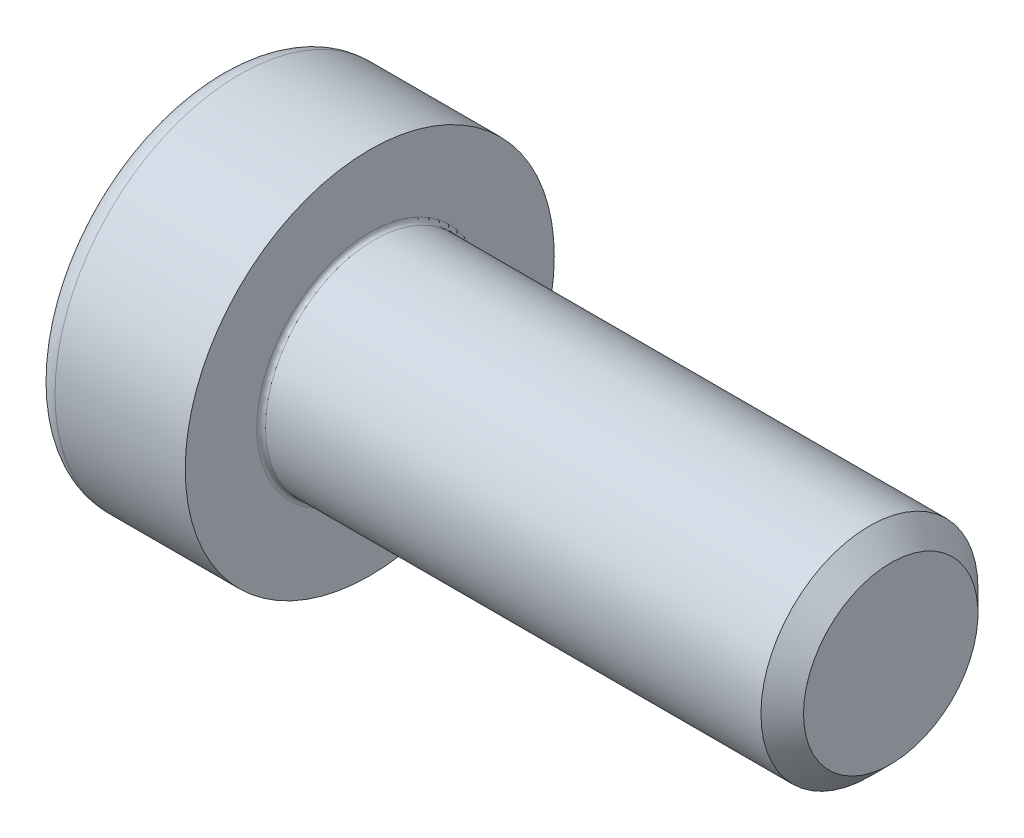
ISO-10303-21;
HEADER;
FILE_DESCRIPTION(('STEP AP214'),'2;1');
FILE_NAME('part.step','',(''),(''),'','','');
FILE_SCHEMA(('AUTOMOTIVE_DESIGN { 1 0 10303 214 1 1 1 1 }'));
ENDSEC;
DATA;
#1=APPLICATION_CONTEXT('core data for automotive mechanical design processes');
#2=APPLICATION_PROTOCOL_DEFINITION('international standard','automotive_design',2000,#1);
#3=PRODUCT_CONTEXT('',#1,'mechanical');
#4=PRODUCT('Part','Part','',(#3));
#5=PRODUCT_RELATED_PRODUCT_CATEGORY('part','',(#4));
#6=PRODUCT_DEFINITION_FORMATION('','',#4);
#7=PRODUCT_DEFINITION_CONTEXT('part definition',#1,'design');
#8=PRODUCT_DEFINITION('design','',#6,#7);
#9=PRODUCT_DEFINITION_SHAPE('','',#8);
#10=(LENGTH_UNIT() NAMED_UNIT(*) SI_UNIT(.MILLI.,.METRE.));
#11=(NAMED_UNIT(*) PLANE_ANGLE_UNIT() SI_UNIT($,.RADIAN.));
#12=(NAMED_UNIT(*) SI_UNIT($,.STERADIAN.) SOLID_ANGLE_UNIT());
#13=UNCERTAINTY_MEASURE_WITH_UNIT(LENGTH_MEASURE(1.E-05),#10,'distance_accuracy_value','');
#14=(GEOMETRIC_REPRESENTATION_CONTEXT(3) GLOBAL_UNCERTAINTY_ASSIGNED_CONTEXT((#13)) GLOBAL_UNIT_ASSIGNED_CONTEXT((#10,
#11,#12)) REPRESENTATION_CONTEXT('',''));
#15=CARTESIAN_POINT('',(0.,0.,0.));
#16=DIRECTION('',(0.,0.,1.));
#17=DIRECTION('',(1.,0.,0.));
#18=AXIS2_PLACEMENT_3D('',#15,#16,#17);
#19=CARTESIAN_POINT('',(-3.5,1.5,0.866025403784437));
#20=DIRECTION('',(0.,1.,0.));
#21=DIRECTION('',(0.,0.,1.));
#22=AXIS2_PLACEMENT_3D('',#19,#20,#21);
#23=PLANE('',#22);
#24=DIRECTION('',(0.,0.,1.));
#25=VECTOR('',#24,1.);
#26=CARTESIAN_POINT('',(-3.5,1.5,0.866025403784437));
#27=LINE('',#26,#25);
#28=CARTESIAN_POINT('',(-3.5,1.5,-0.86602540378444));
#29=VERTEX_POINT('',#28);
#30=CARTESIAN_POINT('',(-3.5,1.50000001434956,0.866025395499716));
#31=VERTEX_POINT('',#30);
#32=EDGE_CURVE('E81',#29,#31,#27,.T.);
#33=ORIENTED_EDGE('',*,*,#32,.F.);
#34=DIRECTION('',(1.,0.,0.));
#35=VECTOR('',#34,1.);
#36=CARTESIAN_POINT('',(-3.5,1.5,-0.86602540378444));
#37=LINE('',#36,#35);
#38=CARTESIAN_POINT('',(-0.800000006220233,1.5,-0.866025425304596));
#39=VERTEX_POINT('',#38);
#40=EDGE_CURVE('E84',#29,#39,#37,.T.);
#41=ORIENTED_EDGE('',*,*,#40,.T.);
#42=CARTESIAN_POINT('',(-0.800000012432567,1.5,-0.866025446824751));
#43=CARTESIAN_POINT('',(-0.778021670271403,1.5,-0.789912302835366));
#44=CARTESIAN_POINT('',(-0.758033518179528,1.5,-0.713142151271645));
#45=CARTESIAN_POINT('',(-0.72314479867253,1.5,-0.558272624270886));
#46=CARTESIAN_POINT('',(-0.708256572216875,1.5,-0.480170497997477));
#47=CARTESIAN_POINT('',(-0.685081973853415,1.5,-0.324934125860524));
#48=CARTESIAN_POINT('',(-0.676641344183139,1.5,-0.247823758413355));
#49=CARTESIAN_POINT('',(-0.666566877354559,1.5,-0.0932403829638634));
#50=CARTESIAN_POINT('',(-0.664924695666526,1.5,-0.0157679364446982));
#51=CARTESIAN_POINT('',(-0.668349715793717,1.5,0.128981011040013));
#52=CARTESIAN_POINT('',(-0.672575960514088,1.5,0.196279232771601));
#53=CARTESIAN_POINT('',(-0.685967968078844,1.5,0.330437250397973));
#54=CARTESIAN_POINT('',(-0.695138301128548,1.5,0.397296582622611));
#55=CARTESIAN_POINT('',(-0.718062359334658,1.5,0.531730978494216));
#56=CARTESIAN_POINT('',(-0.731913212733723,1.5,0.599289036243065));
#57=CARTESIAN_POINT('',(-0.7633487947386,1.5,0.733397814904674));
#58=CARTESIAN_POINT('',(-0.780926141976628,1.5,0.79995025257974));
#59=CARTESIAN_POINT('',(-0.799999966613416,1.5,0.866025288102551));
#60=B_SPLINE_CURVE_WITH_KNOTS('',3,(#42,#43,#44,#45,#46,#47,#48,#49,#50,#51,#52,#53,#54,#55,#56,
#57,#58,#59),.UNSPECIFIED.,.F.,.F.,(4,2,2,2,2,2,2,2,4),(0.,0.237762011454513,0.476095368404175,
0.708530713077614,0.940680677948168,1.14278082709105,1.3450681142283,1.55184116343041,
1.75820840456203),.UNSPECIFIED.);
#61=CARTESIAN_POINT('',(-0.799999990873968,1.50000002268993,0.866025332843458));
#62=VERTEX_POINT('',#61);
#63=EDGE_CURVE('E70',#39,#62,#60,.T.);
#64=ORIENTED_EDGE('',*,*,#63,.T.);
#65=DIRECTION('',(1.,0.,0.));
#66=VECTOR('',#65,1.);
#67=CARTESIAN_POINT('',(-3.5,1.50000002152434,0.866025391357355));
#68=LINE('',#67,#66);
#69=EDGE_CURVE('E97',#62,#31,#68,.F.);
#70=ORIENTED_EDGE('',*,*,#69,.T.);
#71=EDGE_LOOP('',(#33,#41,#64,#70));
#72=FACE_BOUND('',#71,.T.);
#73=ADVANCED_FACE('F17',(#72),#23,.F.);
#74=CARTESIAN_POINT('',(-3.5,0.,1.73205080756888));
#75=DIRECTION('',(0.,0.500000000000001,0.866025403784438));
#76=DIRECTION('',(0.,-0.866025403784438,0.500000000000001));
#77=AXIS2_PLACEMENT_3D('',#74,#75,#76);
#78=PLANE('',#77);
#79=DIRECTION('',(0.,-0.866025403784438,0.500000000000001));
#80=VECTOR('',#79,1.);
#81=CARTESIAN_POINT('',(-3.5,0.,1.73205080756888));
#82=LINE('',#81,#80);
#83=CARTESIAN_POINT('',(-3.5,2.36670641556077E-09,1.7320508089353));
#84=VERTEX_POINT('',#83);
#85=EDGE_CURVE('E94',#31,#84,#82,.T.);
#86=ORIENTED_EDGE('',*,*,#85,.F.);
#87=ORIENTED_EDGE('',*,*,#69,.F.);
#88=CARTESIAN_POINT('',(-0.799999999140521,2.60213949590292E-09,1.73205080606653));
#89=CARTESIAN_POINT('',(-0.778021658051909,0.0659159182442528,1.69399423442668));
#90=CARTESIAN_POINT('',(-0.758033507103695,0.132400819132616,1.65560915900174));
#91=CARTESIAN_POINT('',(-0.723144789979647,0.266521762493608,1.5781743962483));
#92=CARTESIAN_POINT('',(-0.708256564762364,0.334160187260099,1.53912333350181));
#93=CARTESIAN_POINT('',(-0.685081968883998,0.468598827673235,1.46150514826979));
#94=CARTESIAN_POINT('',(-0.676641340456116,0.535378364006075,1.42294996499167));
#95=CARTESIAN_POINT('',(-0.666566876015663,0.669251492511701,1.34565827821169));
#96=CARTESIAN_POINT('',(-0.664924695473804,0.736344598425948,1.30692205545133));
#97=CARTESIAN_POINT('',(-0.668349717825078,0.861700872474557,1.23454757688476));
#98=CARTESIAN_POINT('',(-0.672575964554391,0.919982851332367,1.2008984607023));
#99=CARTESIAN_POINT('',(-0.68596797755536,1.03616712093172,1.13381944137351));
#100=CARTESIAN_POINT('',(-0.695138314035785,1.09406901012273,1.10038977006249));
#101=CARTESIAN_POINT('',(-0.718062380279471,1.21049263027525,1.0331725616274));
#102=CARTESIAN_POINT('',(-0.731913238329181,1.26899963368743,0.999393527457905));
#103=CARTESIAN_POINT('',(-0.763348830357798,1.38514126087301,0.932339127738187));
#104=CARTESIAN_POINT('',(-0.780926182963769,1.44277737140747,0.899062903806075));
#105=CARTESIAN_POINT('',(-0.800000013151562,1.50000003943099,0.866025381018948));
#106=B_SPLINE_CURVE_WITH_KNOTS('',3,(#88,#89,#90,#91,#92,#93,#94,#95,#96,#97,#98,#99,#100,#101,
#102,#103,#104,#105),.UNSPECIFIED.,.F.,.F.,(4,2,2,2,2,2,2,2,4),(0.,0.237762008511598,
0.47609536245894,0.708530704067682,0.940680665888395,1.14278084715299,1.3450681665294,
1.5518412496249,1.75820852438055),.UNSPECIFIED.);
#107=CARTESIAN_POINT('',(-0.800000000237238,2.18858450204986E-09,1.73205080791087));
#108=VERTEX_POINT('',#107);
#109=EDGE_CURVE('E77',#108,#62,#106,.T.);
#110=ORIENTED_EDGE('',*,*,#109,.F.);
#111=DIRECTION('',(1.,0.,0.));
#112=VECTOR('',#111,1.);
#113=CARTESIAN_POINT('',(-3.5,3.55005911820139E-09,1.7320508096185));
#114=LINE('',#113,#112);
#115=EDGE_CURVE('E206',#108,#84,#114,.F.);
#116=ORIENTED_EDGE('',*,*,#115,.T.);
#117=EDGE_LOOP('',(#86,#87,#110,#116));
#118=FACE_BOUND('',#117,.T.);
#119=ADVANCED_FACE('F122',(#118),#78,.F.);
#120=CARTESIAN_POINT('',(-3.5,1.5,-0.86602540378444));
#121=DIRECTION('',(0.,0.5,-0.866025403784439));
#122=DIRECTION('',(0.,0.866025403784439,0.5));
#123=AXIS2_PLACEMENT_3D('',#120,#121,#122);
#124=PLANE('',#123);
#125=DIRECTION('',(0.,0.866025403784439,0.5));
#126=VECTOR('',#125,1.);
#127=CARTESIAN_POINT('',(-3.5,1.5,-0.86602540378444));
#128=LINE('',#127,#126);
#129=CARTESIAN_POINT('',(-3.5,0.,-1.73205080756888));
#130=VERTEX_POINT('',#129);
#131=EDGE_CURVE('E88',#130,#29,#128,.T.);
#132=ORIENTED_EDGE('',*,*,#131,.F.);
#133=DIRECTION('',(1.,0.,0.));
#134=VECTOR('',#133,1.);
#135=CARTESIAN_POINT('',(-3.5,0.,-1.73205080756888));
#136=LINE('',#135,#134);
#137=CARTESIAN_POINT('',(-0.799999996147988,-2.59692836892128E-08,-1.73205080088601));
#138=VERTEX_POINT('',#137);
#139=EDGE_CURVE('E92',#130,#138,#136,.T.);
#140=ORIENTED_EDGE('',*,*,#139,.T.);
#141=CARTESIAN_POINT('',(-0.799999984583663,1.49999999398993,-0.866025426121797));
#142=CARTESIAN_POINT('',(-0.778021650520149,1.43408407271741,-0.904081988921267));
#143=CARTESIAN_POINT('',(-0.758033502808757,1.36759917014434,-0.942467060358707));
#144=CARTESIAN_POINT('',(-0.723144788711201,1.23347822683197,-1.01990181944736));
#145=CARTESIAN_POINT('',(-0.708256563281757,1.165839803806,-1.05895288252755));
#146=CARTESIAN_POINT('',(-0.68508196769442,1.03140116576452,-1.13657106734227));
#147=CARTESIAN_POINT('',(-0.676641339767,0.964621630082855,-1.1751262498997));
#148=CARTESIAN_POINT('',(-0.666566875935023,0.830748503178975,-1.25241793550448));
#149=CARTESIAN_POINT('',(-0.664924695498078,0.763655398215178,-1.29115415780985));
#150=CARTESIAN_POINT('',(-0.668349717905383,0.638299126743436,-1.36352863494737));
#151=CARTESIAN_POINT('',(-0.672575964523277,0.580017149518255,-1.39717775016728));
#152=CARTESIAN_POINT('',(-0.685967977017522,0.463832883152867,-1.4642567676142));
#153=CARTESIAN_POINT('',(-0.69513831310386,0.405930995563309,-1.49768643800586));
#154=CARTESIAN_POINT('',(-0.718062378311161,0.28950737874517,-1.56490364452014));
#155=CARTESIAN_POINT('',(-0.731913235702844,0.231000377063204,-1.59868267768962));
#156=CARTESIAN_POINT('',(-0.763348826236472,0.114858753307733,-1.66573707542679));
#157=CARTESIAN_POINT('',(-0.780926178004428,0.0572226444729956,-1.69901329837649));
#158=CARTESIAN_POINT('',(-0.800000007299001,-2.18733048714975E-08,-1.73205082019744));
#159=B_SPLINE_CURVE_WITH_KNOTS('',3,(#141,#142,#143,#144,#145,#146,#147,#148,#149,#150,#151,
#152,#153,#154,#155,#156,#157,#158),.UNSPECIFIED.,.F.,.F.,(4,2,2,2,2,2,2,2,4),(0.,
0.23776200453855,0.476095354800071,0.708530693417361,0.940680652127613,1.14278082770383,
1.34506814144736,1.55184121828047,1.75820848670916),.UNSPECIFIED.);
#160=EDGE_CURVE('E74',#39,#138,#159,.T.);
#161=ORIENTED_EDGE('',*,*,#160,.F.);
#162=ORIENTED_EDGE('',*,*,#40,.F.);
#163=EDGE_LOOP('',(#132,#140,#161,#162));
#164=FACE_BOUND('',#163,.T.);
#165=ADVANCED_FACE('F90',(#164),#124,.F.);
#166=CARTESIAN_POINT('',(-0.805999997623985,0.,0.));
#167=DIRECTION('',(-1.,0.,0.));
#168=DIRECTION('',(0.,0.,1.));
#169=AXIS2_PLACEMENT_3D('',#166,#167,#168);
#170=CONICAL_SURFACE('',#169,1.74244310829863,1.04719755119367);
#171=CARTESIAN_POINT('',(0.200000000006639,0.,0.));
#172=VERTEX_POINT('',#171);
#173=VERTEX_LOOP('',#172);
#174=FACE_BOUND('',#173,.T.);
#175=ORIENTED_EDGE('',*,*,#160,.T.);
#176=CARTESIAN_POINT('',(-0.799999988529364,-3.44122793442723E-08,-1.73205078770094));
#177=CARTESIAN_POINT('',(-0.778021648311073,-0.0659159495199128,-1.69399421636967));
#178=CARTESIAN_POINT('',(-0.758033498287448,-0.132400849870365,-1.65560914125529));
#179=CARTESIAN_POINT('',(-0.723144783082687,-0.266521792102774,-1.57817437915344));
#180=CARTESIAN_POINT('',(-0.70825655885892,-0.334160216278253,-1.53912331674817));
#181=CARTESIAN_POINT('',(-0.685081964946078,-0.468598855527711,-1.46150513218801));
#182=CARTESIAN_POINT('',(-0.676641337495724,-0.535378391290187,-1.42294994923918));
#183=CARTESIAN_POINT('',(-0.666566874944027,-0.669251518588872,-1.34565826315603));
#184=CARTESIAN_POINT('',(-0.664924695314174,-0.736344623866673,-1.30692204076312));
#185=CARTESIAN_POINT('',(-0.668349719123336,-0.861700893152402,-1.2345475649464));
#186=CARTESIAN_POINT('',(-0.672575966101573,-0.91998286789904,-1.20089845113753));
#187=CARTESIAN_POINT('',(-0.685967978869557,-1.03616712930376,-1.13381943653991));
#188=CARTESIAN_POINT('',(-0.695138314866413,-1.09406901441143,-1.10038976758641));
#189=CARTESIAN_POINT('',(-0.718062379492155,-1.21049262627729,-1.03317256393563));
#190=CARTESIAN_POINT('',(-0.731913236384259,-1.26899962548969,-0.999393532190876));
#191=CARTESIAN_POINT('',(-0.763348825615376,-1.38514124441669,-0.932339137239251));
#192=CARTESIAN_POINT('',(-0.780926176583787,-1.44277735089185,-0.899062915650775));
#193=CARTESIAN_POINT('',(-0.800000004972312,-1.50000001491657,-0.866025395172358));
#194=B_SPLINE_CURVE_WITH_KNOTS('',3,(#176,#177,#178,#179,#180,#181,#182,#183,#184,#185,#186,
#187,#188,#189,#190,#191,#192,#193),.UNSPECIFIED.,.F.,.F.,(4,2,2,2,2,2,2,2,4),(0.,
0.2377620060049,0.476095357377757,0.708530696703011,0.940680656266892,1.14278082341054,
1.34506812861263,1.55184119678181,1.75820845671576),.UNSPECIFIED.);
#195=CARTESIAN_POINT('',(-0.800000002758283,-1.50000000827448,-0.866025399007168));
#196=VERTEX_POINT('',#195);
#197=EDGE_CURVE('E185',#138,#196,#194,.T.);
#198=ORIENTED_EDGE('',*,*,#197,.T.);
#199=CARTESIAN_POINT('',(-0.799999989622273,-1.5,-0.866025367834514));
#200=CARTESIAN_POINT('',(-0.778021649314475,-1.5,-0.789912225108993));
#201=CARTESIAN_POINT('',(-0.758033499195718,-1.5,-0.71314207481686));
#202=CARTESIAN_POINT('',(-0.723144783793387,-1.5,-0.558272550480237));
#203=CARTESIAN_POINT('',(-0.708256559467297,-1.5,-0.480170425600095));
#204=CARTESIAN_POINT('',(-0.685081965351673,-1.5,-0.324934056341402));
#205=CARTESIAN_POINT('',(-0.676641337800399,-1.5,-0.247823690375233));
#206=CARTESIAN_POINT('',(-0.666566875053828,-1.5,-0.0932403180638876));
#207=CARTESIAN_POINT('',(-0.664924695329943,-1.5,-0.0157678732015718));
#208=CARTESIAN_POINT('',(-0.668349718984917,-1.5,0.12898107883546));
#209=CARTESIAN_POINT('',(-0.672575965920744,-1.5,0.196279306778827));
#210=CARTESIAN_POINT('',(-0.685967978656193,-1.5,0.330437336624712));
#211=CARTESIAN_POINT('',(-0.69513831466304,-1.5,0.39729667485675));
#212=CARTESIAN_POINT('',(-0.71806237935618,-1.5,0.53173108281893));
#213=CARTESIAN_POINT('',(-0.731913236307367,-1.5,0.599289146643764));
#214=CARTESIAN_POINT('',(-0.76334882569326,-1.5,0.733397937206872));
#215=CARTESIAN_POINT('',(-0.780926176757203,-1.5,0.799950380708394));
#216=CARTESIAN_POINT('',(-0.80000000525412,-1.5,0.866025421984823));
#217=B_SPLINE_CURVE_WITH_KNOTS('',3,(#199,#200,#201,#202,#203,#204,#205,#206,#207,#208,#209,
#210,#211,#212,#213,#214,#215,#216),.UNSPECIFIED.,.F.,.F.,(4,2,2,2,2,2,2,2,4),(0.,
0.237762006261274,0.476095357897238,0.708530697459831,0.940680657258487,1.14278082536587,
1.34506813153537,1.55184120072383,1.75820846167024),.UNSPECIFIED.);
#218=CARTESIAN_POINT('',(-0.799999998563129,-1.49999998741677,0.866025420601342));
#219=VERTEX_POINT('',#218);
#220=EDGE_CURVE('E176',#196,#219,#217,.T.);
#221=ORIENTED_EDGE('',*,*,#220,.T.);
#222=CARTESIAN_POINT('',(-0.799999991611302,-1.49999997483354,0.866025418314301));
#223=CARTESIAN_POINT('',(-0.778021651142396,-1.43408405957754,0.904081989731233));
#224=CARTESIAN_POINT('',(-0.758033500851991,-1.36759915907781,0.942467064931796));
#225=CARTESIAN_POINT('',(-0.723144785092314,-1.23347821653263,1.01990182721422));
#226=CARTESIAN_POINT('',(-0.708256560580681,-1.16583979219357,1.05895288971394));
#227=CARTESIAN_POINT('',(-0.685081966093905,-1.03140115260715,1.13657107446865));
#228=CARTESIAN_POINT('',(-0.676641338357293,-0.964621616671779,1.17512625751729));
#229=CARTESIAN_POINT('',(-0.666566875254049,-0.830748489006765,1.25241794381195));
#230=CARTESIAN_POINT('',(-0.664924695358747,-0.763655383535567,1.29115416631651));
#231=CARTESIAN_POINT('',(-0.66834971869422,-0.638299114669639,1.36352864189086));
#232=CARTESIAN_POINT('',(-0.672575965386404,-0.580017140536749,1.39717775534539));
#233=CARTESIAN_POINT('',(-0.685967977500712,-0.463832880337524,1.46425676924701));
#234=CARTESIAN_POINT('',(-0.695138313129732,-0.405930995821562,1.49768643785889));
#235=CARTESIAN_POINT('',(-0.718062376958103,-0.289507385145422,1.56490364082278));
#236=CARTESIAN_POINT('',(-0.731913233418245,-0.231000386530297,1.5986826722227));
#237=CARTESIAN_POINT('',(-0.763348821758497,-0.114858768772663,1.66573706649919));
#238=CARTESIAN_POINT('',(-0.780926172268345,-0.0572226628696956,1.69901328775731));
#239=CARTESIAN_POINT('',(-0.800000000196727,5.89813991647596E-10,1.73205080790941));
#240=B_SPLINE_CURVE_WITH_KNOTS('',3,(#222,#223,#224,#225,#226,#227,#228,#229,#230,#231,#232,
#233,#234,#235,#236,#237,#238,#239),.UNSPECIFIED.,.F.,.F.,(4,2,2,2,2,2,2,2,4),(0.,
0.237762006708336,0.476095358801109,0.708530698815507,0.940680659063121,1.14278082403675,
1.34506812706112,1.5518411929441,1.75820845061189),.UNSPECIFIED.);
#241=EDGE_CURVE('E87',#219,#108,#240,.T.);
#242=ORIENTED_EDGE('',*,*,#241,.T.);
#243=ORIENTED_EDGE('',*,*,#109,.T.);
#244=ORIENTED_EDGE('',*,*,#63,.F.);
#245=EDGE_LOOP('',(#175,#198,#221,#242,#243,#244));
#246=FACE_BOUND('',#245,.T.);
#247=ADVANCED_FACE('F72',(#174,#246),#170,.F.);
#248=CARTESIAN_POINT('',(-3.5,-1.5,0.866025403784439));
#249=DIRECTION('',(0.,-0.5,0.866025403784439));
#250=DIRECTION('',(0.,-0.866025403784439,-0.5));
#251=AXIS2_PLACEMENT_3D('',#248,#249,#250);
#252=PLANE('',#251);
#253=DIRECTION('',(0.,-0.866025403784439,-0.5));
#254=VECTOR('',#253,1.);
#255=CARTESIAN_POINT('',(-3.5,-1.5,0.866025403784439));
#256=LINE('',#255,#254);
#257=CARTESIAN_POINT('',(-3.5,-1.4999999973103,0.866025417760504));
#258=VERTEX_POINT('',#257);
#259=EDGE_CURVE('E35',#84,#258,#256,.T.);
#260=ORIENTED_EDGE('',*,*,#259,.F.);
#261=ORIENTED_EDGE('',*,*,#115,.F.);
#262=ORIENTED_EDGE('',*,*,#241,.F.);
#263=DIRECTION('',(1.,0.,0.));
#264=VECTOR('',#263,1.);
#265=CARTESIAN_POINT('',(-3.5,-1.5,0.866025428630777));
#266=LINE('',#265,#264);
#267=EDGE_CURVE('E182',#219,#258,#266,.F.);
#268=ORIENTED_EDGE('',*,*,#267,.T.);
#269=EDGE_LOOP('',(#260,#261,#262,#268));
#270=FACE_BOUND('',#269,.T.);
#271=ADVANCED_FACE('F192',(#270),#252,.F.);
#272=CARTESIAN_POINT('',(-3.5,0.,-1.73205080756888));
#273=DIRECTION('',(0.,-0.5,-0.866025403784439));
#274=DIRECTION('',(0.,0.866025403784439,-0.5));
#275=AXIS2_PLACEMENT_3D('',#272,#273,#274);
#276=PLANE('',#275);
#277=DIRECTION('',(0.,0.866025403784439,-0.5));
#278=VECTOR('',#277,1.);
#279=CARTESIAN_POINT('',(-3.5,0.,-1.73205080756888));
#280=LINE('',#279,#278);
#281=CARTESIAN_POINT('',(-3.5,-1.5,-0.86602540378444));
#282=VERTEX_POINT('',#281);
#283=EDGE_CURVE('E210',#282,#130,#280,.T.);
#284=ORIENTED_EDGE('',*,*,#283,.F.);
#285=DIRECTION('',(1.,0.,0.));
#286=VECTOR('',#285,1.);
#287=CARTESIAN_POINT('',(-3.5,-1.5,-0.86602540378444));
#288=LINE('',#287,#286);
#289=EDGE_CURVE('E245',#282,#196,#288,.T.);
#290=ORIENTED_EDGE('',*,*,#289,.T.);
#291=ORIENTED_EDGE('',*,*,#197,.F.);
#292=ORIENTED_EDGE('',*,*,#139,.F.);
#293=EDGE_LOOP('',(#284,#290,#291,#292));
#294=FACE_BOUND('',#293,.T.);
#295=ADVANCED_FACE('F172',(#294),#276,.F.);
#296=CARTESIAN_POINT('',(-3.5,-1.5,-0.866025403784438));
#297=DIRECTION('',(0.,-1.,0.));
#298=DIRECTION('',(0.,0.,-1.));
#299=AXIS2_PLACEMENT_3D('',#296,#297,#298);
#300=PLANE('',#299);
#301=DIRECTION('',(0.,0.,1.));
#302=VECTOR('',#301,1.);
#303=CARTESIAN_POINT('',(-3.5,-1.5,0.));
#304=LINE('',#303,#302);
#305=EDGE_CURVE('E233',#258,#282,#304,.F.);
#306=ORIENTED_EDGE('',*,*,#305,.F.);
#307=ORIENTED_EDGE('',*,*,#267,.F.);
#308=ORIENTED_EDGE('',*,*,#220,.F.);
#309=ORIENTED_EDGE('',*,*,#289,.F.);
#310=EDGE_LOOP('',(#306,#307,#308,#309));
#311=FACE_BOUND('',#310,.T.);
#312=ADVANCED_FACE('F145',(#311),#300,.F.);
#313=CARTESIAN_POINT('',(-3.5,2.99102540378444,0.));
#314=DIRECTION('',(-1.,0.,0.));
#315=DIRECTION('',(0.,-1.,0.));
#316=AXIS2_PLACEMENT_3D('',#313,#314,#315);
#317=PLANE('',#316);
#318=CARTESIAN_POINT('',(-3.5,0.,0.));
#319=DIRECTION('',(1.,0.,0.));
#320=DIRECTION('',(0.,1.,0.));
#321=AXIS2_PLACEMENT_3D('',#318,#319,#320);
#322=CIRCLE('',#321,3.75);
#323=CARTESIAN_POINT('',(-3.5,3.75,0.));
#324=VERTEX_POINT('',#323);
#325=EDGE_CURVE('E229',#324,#324,#322,.T.);
#326=ORIENTED_EDGE('',*,*,#325,.F.);
#327=EDGE_LOOP('',(#326));
#328=FACE_BOUND('',#327,.T.);
#329=ORIENTED_EDGE('',*,*,#259,.T.);
#330=ORIENTED_EDGE('',*,*,#305,.T.);
#331=ORIENTED_EDGE('',*,*,#283,.T.);
#332=ORIENTED_EDGE('',*,*,#131,.T.);
#333=ORIENTED_EDGE('',*,*,#32,.T.);
#334=ORIENTED_EDGE('',*,*,#85,.T.);
#335=EDGE_LOOP('',(#329,#330,#331,#332,#333,#334));
#336=FACE_BOUND('',#335,.T.);
#337=ADVANCED_FACE('F135',(#328,#336),#317,.T.);
#338=CARTESIAN_POINT('',(-3.,0.,0.));
#339=DIRECTION('',(1.,0.,0.));
#340=DIRECTION('',(0.,1.,0.));
#341=AXIS2_PLACEMENT_3D('',#338,#339,#340);
#342=TOROIDAL_SURFACE('',#341,3.75,0.500000000000001);
#343=CARTESIAN_POINT('',(-3.,0.,0.));
#344=DIRECTION('',(1.,0.,0.));
#345=DIRECTION('',(0.,1.,0.));
#346=AXIS2_PLACEMENT_3D('',#343,#344,#345);
#347=CIRCLE('',#346,4.25);
#348=CARTESIAN_POINT('',(-3.,4.25,0.));
#349=VERTEX_POINT('',#348);
#350=EDGE_CURVE('E232',#349,#349,#347,.T.);
#351=ORIENTED_EDGE('',*,*,#350,.F.);
#352=EDGE_LOOP('',(#351));
#353=FACE_BOUND('',#352,.T.);
#354=ORIENTED_EDGE('',*,*,#325,.T.);
#355=EDGE_LOOP('',(#354));
#356=FACE_BOUND('',#355,.T.);
#357=ADVANCED_FACE('F132',(#353,#356),#342,.T.);
#358=CARTESIAN_POINT('',(-1.75,0.,0.));
#359=DIRECTION('',(1.,0.,0.));
#360=DIRECTION('',(0.,1.,0.));
#361=AXIS2_PLACEMENT_3D('',#358,#359,#360);
#362=CYLINDRICAL_SURFACE('',#361,4.25);
#363=ORIENTED_EDGE('',*,*,#350,.T.);
#364=EDGE_LOOP('',(#363));
#365=FACE_BOUND('',#364,.T.);
#366=CARTESIAN_POINT('',(0.,0.,0.));
#367=DIRECTION('',(1.,0.,0.));
#368=DIRECTION('',(0.,1.,0.));
#369=AXIS2_PLACEMENT_3D('',#366,#367,#368);
#370=CIRCLE('',#369,4.25);
#371=CARTESIAN_POINT('',(0.,4.25,0.));
#372=VERTEX_POINT('',#371);
#373=EDGE_CURVE('E183',#372,#372,#370,.T.);
#374=ORIENTED_EDGE('',*,*,#373,.F.);
#375=EDGE_LOOP('',(#374));
#376=FACE_BOUND('',#375,.T.);
#377=ADVANCED_FACE('F134',(#365,#376),#362,.T.);
#378=CARTESIAN_POINT('',(0.,3.375,0.));
#379=DIRECTION('',(1.,0.,0.));
#380=DIRECTION('',(0.,1.,0.));
#381=AXIS2_PLACEMENT_3D('',#378,#379,#380);
#382=PLANE('',#381);
#383=ORIENTED_EDGE('',*,*,#373,.T.);
#384=EDGE_LOOP('',(#383));
#385=FACE_BOUND('',#384,.T.);
#386=CARTESIAN_POINT('',(0.,0.,0.));
#387=DIRECTION('',(1.,0.,0.));
#388=DIRECTION('',(0.,1.,0.));
#389=AXIS2_PLACEMENT_3D('',#386,#387,#388);
#390=CIRCLE('',#389,2.6);
#391=CARTESIAN_POINT('',(0.,2.6,0.));
#392=VERTEX_POINT('',#391);
#393=EDGE_CURVE('E236',#392,#392,#390,.F.);
#394=ORIENTED_EDGE('',*,*,#393,.T.);
#395=EDGE_LOOP('',(#394));
#396=FACE_BOUND('',#395,.T.);
#397=ADVANCED_FACE('F142',(#385,#396),#382,.T.);
#398=CARTESIAN_POINT('',(12.,1.25,0.));
#399=DIRECTION('',(1.,0.,0.));
#400=DIRECTION('',(0.,1.,0.));
#401=AXIS2_PLACEMENT_3D('',#398,#399,#400);
#402=PLANE('',#401);
#403=CARTESIAN_POINT('',(11.9999999999436,0.,0.));
#404=DIRECTION('',(-1.,0.,0.));
#405=DIRECTION('',(0.,0.,1.));
#406=AXIS2_PLACEMENT_3D('',#403,#404,#405);
#407=CIRCLE('',#406,2.00923999994984);
#408=CARTESIAN_POINT('',(11.9999999999436,0.,2.00923999994984));
#409=VERTEX_POINT('',#408);
#410=EDGE_CURVE('E234',#409,#409,#407,.T.);
#411=ORIENTED_EDGE('',*,*,#410,.F.);
#412=EDGE_LOOP('',(#411));
#413=FACE_BOUND('',#412,.T.);
#414=ADVANCED_FACE('F162',(#413),#402,.T.);
#415=CARTESIAN_POINT('',(0.100000000000002,0.,0.));
#416=DIRECTION('',(1.,0.,0.));
#417=DIRECTION('',(0.,1.,0.));
#418=AXIS2_PLACEMENT_3D('',#415,#416,#417);
#419=TOROIDAL_SURFACE('',#418,2.6,0.1);
#420=ORIENTED_EDGE('',*,*,#393,.F.);
#421=EDGE_LOOP('',(#420));
#422=FACE_BOUND('',#421,.T.);
#423=CARTESIAN_POINT('',(0.100000000000002,0.,0.));
#424=DIRECTION('',(1.,0.,0.));
#425=DIRECTION('',(0.,1.,0.));
#426=AXIS2_PLACEMENT_3D('',#423,#424,#425);
#427=CIRCLE('',#426,2.5);
#428=CARTESIAN_POINT('',(0.100000000000002,2.5,0.));
#429=VERTEX_POINT('',#428);
#430=EDGE_CURVE('E21',#429,#429,#427,.T.);
#431=ORIENTED_EDGE('',*,*,#430,.F.);
#432=EDGE_LOOP('',(#431));
#433=FACE_BOUND('',#432,.T.);
#434=ADVANCED_FACE('F19',(#422,#433),#419,.F.);
#435=CARTESIAN_POINT('',(11.5092400000094,0.,0.));
#436=DIRECTION('',(-1.,0.,0.));
#437=DIRECTION('',(0.,0.,1.));
#438=AXIS2_PLACEMENT_3D('',#435,#436,#437);
#439=CONICAL_SURFACE('',#438,2.49999999988404,0.785398163397448);
#440=CARTESIAN_POINT('',(11.50924,0.,0.));
#441=DIRECTION('',(1.,0.,0.));
#442=DIRECTION('',(0.,1.,0.));
#443=AXIS2_PLACEMENT_3D('',#440,#441,#442);
#444=CIRCLE('',#443,2.5);
#445=CARTESIAN_POINT('',(11.50924,2.5,0.));
#446=VERTEX_POINT('',#445);
#447=EDGE_CURVE('E11',#446,#446,#444,.F.);
#448=ORIENTED_EDGE('',*,*,#447,.F.);
#449=EDGE_LOOP('',(#448));
#450=FACE_BOUND('',#449,.T.);
#451=ORIENTED_EDGE('',*,*,#410,.T.);
#452=EDGE_LOOP('',(#451));
#453=FACE_BOUND('',#452,.T.);
#454=ADVANCED_FACE('F152',(#450,#453),#439,.T.);
#455=CARTESIAN_POINT('',(7.2,0.,0.));
#456=DIRECTION('',(1.,0.,0.));
#457=DIRECTION('',(0.,1.,0.));
#458=AXIS2_PLACEMENT_3D('',#455,#456,#457);
#459=CYLINDRICAL_SURFACE('',#458,2.5);
#460=ORIENTED_EDGE('',*,*,#447,.T.);
#461=EDGE_LOOP('',(#460));
#462=FACE_BOUND('',#461,.T.);
#463=ORIENTED_EDGE('',*,*,#430,.T.);
#464=EDGE_LOOP('',(#463));
#465=FACE_BOUND('',#464,.T.);
#466=ADVANCED_FACE('F150',(#462,#465),#459,.T.);
#467=CLOSED_SHELL('',(#73,#119,#165,#247,#271,#295,#312,#337,#357,#377,#397,#414,#434,#454,#466));
#468=MANIFOLD_SOLID_BREP('B1',#467);
#469=ADVANCED_BREP_SHAPE_REPRESENTATION('',(#18,#468),#14);
#470=SHAPE_DEFINITION_REPRESENTATION(#9,#469);
ENDSEC;
END-ISO-10303-21;
